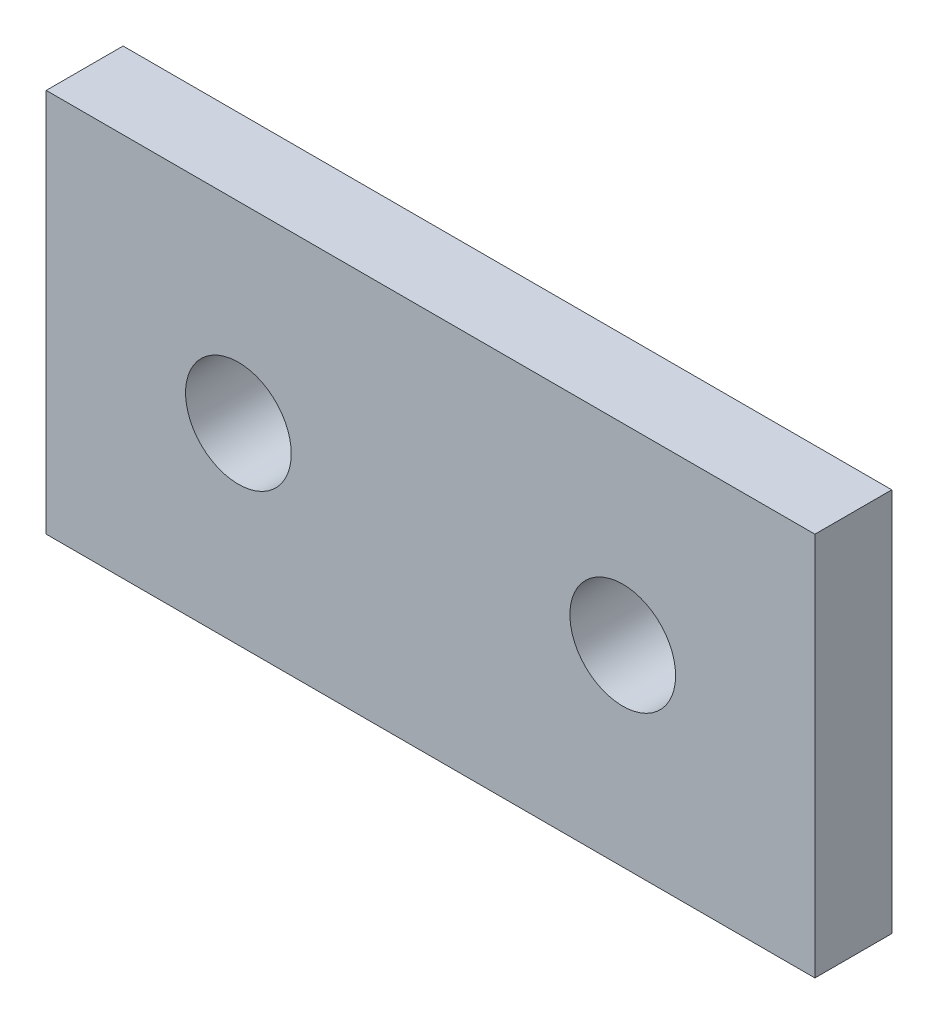
ISO-10303-21;
HEADER;
FILE_DESCRIPTION(('STEP AP214'),'2;1');
FILE_NAME('part.step','',(''),(''),'','','');
FILE_SCHEMA(('AUTOMOTIVE_DESIGN { 1 0 10303 214 1 1 1 1 }'));
ENDSEC;
DATA;
#1=APPLICATION_CONTEXT('core data for automotive mechanical design processes');
#2=APPLICATION_PROTOCOL_DEFINITION('international standard','automotive_design',2000,#1);
#3=PRODUCT_CONTEXT('',#1,'mechanical');
#4=PRODUCT('Part','Part','',(#3));
#5=PRODUCT_RELATED_PRODUCT_CATEGORY('part','',(#4));
#6=PRODUCT_DEFINITION_FORMATION('','',#4);
#7=PRODUCT_DEFINITION_CONTEXT('part definition',#1,'design');
#8=PRODUCT_DEFINITION('design','',#6,#7);
#9=PRODUCT_DEFINITION_SHAPE('','',#8);
#10=(LENGTH_UNIT() NAMED_UNIT(*) SI_UNIT(.MILLI.,.METRE.));
#11=(NAMED_UNIT(*) PLANE_ANGLE_UNIT() SI_UNIT($,.RADIAN.));
#12=(NAMED_UNIT(*) SI_UNIT($,.STERADIAN.) SOLID_ANGLE_UNIT());
#13=UNCERTAINTY_MEASURE_WITH_UNIT(LENGTH_MEASURE(1.E-05),#10,'distance_accuracy_value','');
#14=(GEOMETRIC_REPRESENTATION_CONTEXT(3) GLOBAL_UNCERTAINTY_ASSIGNED_CONTEXT((#13)) GLOBAL_UNIT_ASSIGNED_CONTEXT((#10,
#11,#12)) REPRESENTATION_CONTEXT('',''));
#15=CARTESIAN_POINT('',(0.,0.,0.));
#16=DIRECTION('',(0.,0.,1.));
#17=DIRECTION('',(1.,0.,0.));
#18=AXIS2_PLACEMENT_3D('',#15,#16,#17);
#19=CARTESIAN_POINT('',(0.,0.,2.));
#20=DIRECTION('',(0.,0.,-1.));
#21=DIRECTION('',(-1.,0.,0.));
#22=AXIS2_PLACEMENT_3D('',#19,#20,#21);
#23=PLANE('',#22);
#24=CARTESIAN_POINT('',(-10.,0.,2.));
#25=DIRECTION('',(0.,0.,1.));
#26=DIRECTION('',(1.,0.,0.));
#27=AXIS2_PLACEMENT_3D('',#24,#25,#26);
#28=CIRCLE('',#27,2.75);
#29=CARTESIAN_POINT('',(-7.25,0.,2.));
#30=VERTEX_POINT('',#29);
#31=EDGE_CURVE('E99',#30,#30,#28,.T.);
#32=ORIENTED_EDGE('',*,*,#31,.F.);
#33=EDGE_LOOP('',(#32));
#34=FACE_BOUND('',#33,.T.);
#35=DIRECTION('',(0.,1.,0.));
#36=VECTOR('',#35,1.);
#37=CARTESIAN_POINT('',(20.,-10.,2.));
#38=LINE('',#37,#36);
#39=CARTESIAN_POINT('',(20.,-10.,2.));
#40=VERTEX_POINT('',#39);
#41=CARTESIAN_POINT('',(20.,10.,2.));
#42=VERTEX_POINT('',#41);
#43=EDGE_CURVE('E84',#40,#42,#38,.T.);
#44=ORIENTED_EDGE('',*,*,#43,.T.);
#45=DIRECTION('',(-1.,0.,0.));
#46=VECTOR('',#45,1.);
#47=CARTESIAN_POINT('',(-20.,10.,2.));
#48=LINE('',#47,#46);
#49=CARTESIAN_POINT('',(-20.,10.,2.));
#50=VERTEX_POINT('',#49);
#51=EDGE_CURVE('E79',#42,#50,#48,.T.);
#52=ORIENTED_EDGE('',*,*,#51,.T.);
#53=DIRECTION('',(0.,-1.,0.));
#54=VECTOR('',#53,1.);
#55=CARTESIAN_POINT('',(-20.,-10.,2.));
#56=LINE('',#55,#54);
#57=CARTESIAN_POINT('',(-20.,-10.,2.));
#58=VERTEX_POINT('',#57);
#59=EDGE_CURVE('E82',#50,#58,#56,.T.);
#60=ORIENTED_EDGE('',*,*,#59,.T.);
#61=DIRECTION('',(1.,0.,0.));
#62=VECTOR('',#61,1.);
#63=CARTESIAN_POINT('',(-20.,-10.,2.));
#64=LINE('',#63,#62);
#65=EDGE_CURVE('E49',#58,#40,#64,.T.);
#66=ORIENTED_EDGE('',*,*,#65,.T.);
#67=EDGE_LOOP('',(#44,#52,#60,#66));
#68=FACE_BOUND('',#67,.T.);
#69=CARTESIAN_POINT('',(10.,0.,2.));
#70=DIRECTION('',(0.,0.,1.));
#71=DIRECTION('',(1.,0.,0.));
#72=AXIS2_PLACEMENT_3D('',#69,#70,#71);
#73=CIRCLE('',#72,2.75);
#74=CARTESIAN_POINT('',(12.75,0.,2.));
#75=VERTEX_POINT('',#74);
#76=EDGE_CURVE('E114',#75,#75,#73,.T.);
#77=ORIENTED_EDGE('',*,*,#76,.F.);
#78=EDGE_LOOP('',(#77));
#79=FACE_BOUND('',#78,.T.);
#80=ADVANCED_FACE('F32',(#34,#68,#79),#23,.F.);
#81=CARTESIAN_POINT('',(0.,0.,-2.));
#82=DIRECTION('',(0.,0.,-1.));
#83=DIRECTION('',(-1.,0.,0.));
#84=AXIS2_PLACEMENT_3D('',#81,#82,#83);
#85=PLANE('',#84);
#86=CARTESIAN_POINT('',(-10.,0.,-2.));
#87=DIRECTION('',(0.,0.,1.));
#88=DIRECTION('',(1.,0.,0.));
#89=AXIS2_PLACEMENT_3D('',#86,#87,#88);
#90=CIRCLE('',#89,2.75);
#91=CARTESIAN_POINT('',(-7.25,0.,-2.));
#92=VERTEX_POINT('',#91);
#93=EDGE_CURVE('E111',#92,#92,#90,.T.);
#94=ORIENTED_EDGE('',*,*,#93,.T.);
#95=EDGE_LOOP('',(#94));
#96=FACE_BOUND('',#95,.T.);
#97=DIRECTION('',(0.,1.,0.));
#98=VECTOR('',#97,1.);
#99=CARTESIAN_POINT('',(20.,-10.,-2.));
#100=LINE('',#99,#98);
#101=CARTESIAN_POINT('',(20.,-10.,-2.));
#102=VERTEX_POINT('',#101);
#103=CARTESIAN_POINT('',(20.,10.,-2.));
#104=VERTEX_POINT('',#103);
#105=EDGE_CURVE('E96',#102,#104,#100,.T.);
#106=ORIENTED_EDGE('',*,*,#105,.F.);
#107=DIRECTION('',(1.,0.,0.));
#108=VECTOR('',#107,1.);
#109=CARTESIAN_POINT('',(-20.,-10.,-2.));
#110=LINE('',#109,#108);
#111=CARTESIAN_POINT('',(-20.,-10.,-2.));
#112=VERTEX_POINT('',#111);
#113=EDGE_CURVE('E72',#112,#102,#110,.T.);
#114=ORIENTED_EDGE('',*,*,#113,.F.);
#115=DIRECTION('',(0.,-1.,0.));
#116=VECTOR('',#115,1.);
#117=CARTESIAN_POINT('',(-20.,-10.,-2.));
#118=LINE('',#117,#116);
#119=CARTESIAN_POINT('',(-20.,10.,-2.));
#120=VERTEX_POINT('',#119);
#121=EDGE_CURVE('E66',#120,#112,#118,.T.);
#122=ORIENTED_EDGE('',*,*,#121,.F.);
#123=DIRECTION('',(-1.,0.,0.));
#124=VECTOR('',#123,1.);
#125=CARTESIAN_POINT('',(-20.,10.,-2.));
#126=LINE('',#125,#124);
#127=EDGE_CURVE('E88',#104,#120,#126,.T.);
#128=ORIENTED_EDGE('',*,*,#127,.F.);
#129=EDGE_LOOP('',(#106,#114,#122,#128));
#130=FACE_BOUND('',#129,.T.);
#131=CARTESIAN_POINT('',(10.,0.,-2.));
#132=DIRECTION('',(0.,0.,1.));
#133=DIRECTION('',(1.,0.,0.));
#134=AXIS2_PLACEMENT_3D('',#131,#132,#133);
#135=CIRCLE('',#134,2.75);
#136=CARTESIAN_POINT('',(12.75,0.,-2.));
#137=VERTEX_POINT('',#136);
#138=EDGE_CURVE('E117',#137,#137,#135,.T.);
#139=ORIENTED_EDGE('',*,*,#138,.T.);
#140=EDGE_LOOP('',(#139));
#141=FACE_BOUND('',#140,.T.);
#142=ADVANCED_FACE('F107',(#96,#130,#141),#85,.T.);
#143=CARTESIAN_POINT('',(20.,-10.,2.));
#144=DIRECTION('',(-1.,0.,0.));
#145=DIRECTION('',(0.,0.,1.));
#146=AXIS2_PLACEMENT_3D('',#143,#144,#145);
#147=PLANE('',#146);
#148=ORIENTED_EDGE('',*,*,#105,.T.);
#149=DIRECTION('',(0.,0.,-1.));
#150=VECTOR('',#149,1.);
#151=CARTESIAN_POINT('',(20.,10.,2.));
#152=LINE('',#151,#150);
#153=EDGE_CURVE('E11',#42,#104,#152,.T.);
#154=ORIENTED_EDGE('',*,*,#153,.F.);
#155=ORIENTED_EDGE('',*,*,#43,.F.);
#156=DIRECTION('',(0.,0.,-1.));
#157=VECTOR('',#156,1.);
#158=CARTESIAN_POINT('',(20.,-10.,2.));
#159=LINE('',#158,#157);
#160=EDGE_CURVE('E92',#40,#102,#159,.T.);
#161=ORIENTED_EDGE('',*,*,#160,.T.);
#162=EDGE_LOOP('',(#148,#154,#155,#161));
#163=FACE_BOUND('',#162,.T.);
#164=ADVANCED_FACE('F34',(#163),#147,.F.);
#165=CARTESIAN_POINT('',(-20.,10.,2.));
#166=DIRECTION('',(0.,-1.,0.));
#167=DIRECTION('',(0.,0.,-1.));
#168=AXIS2_PLACEMENT_3D('',#165,#166,#167);
#169=PLANE('',#168);
#170=ORIENTED_EDGE('',*,*,#127,.T.);
#171=DIRECTION('',(0.,0.,-1.));
#172=VECTOR('',#171,1.);
#173=CARTESIAN_POINT('',(-20.,10.,2.));
#174=LINE('',#173,#172);
#175=EDGE_CURVE('E41',#50,#120,#174,.T.);
#176=ORIENTED_EDGE('',*,*,#175,.F.);
#177=ORIENTED_EDGE('',*,*,#51,.F.);
#178=ORIENTED_EDGE('',*,*,#153,.T.);
#179=EDGE_LOOP('',(#170,#176,#177,#178));
#180=FACE_BOUND('',#179,.T.);
#181=ADVANCED_FACE('F87',(#180),#169,.F.);
#182=CARTESIAN_POINT('',(-20.,-10.,2.));
#183=DIRECTION('',(1.,0.,0.));
#184=DIRECTION('',(0.,0.,-1.));
#185=AXIS2_PLACEMENT_3D('',#182,#183,#184);
#186=PLANE('',#185);
#187=ORIENTED_EDGE('',*,*,#121,.T.);
#188=DIRECTION('',(0.,0.,-1.));
#189=VECTOR('',#188,1.);
#190=CARTESIAN_POINT('',(-20.,-10.,2.));
#191=LINE('',#190,#189);
#192=EDGE_CURVE('E89',#58,#112,#191,.T.);
#193=ORIENTED_EDGE('',*,*,#192,.F.);
#194=ORIENTED_EDGE('',*,*,#59,.F.);
#195=ORIENTED_EDGE('',*,*,#175,.T.);
#196=EDGE_LOOP('',(#187,#193,#194,#195));
#197=FACE_BOUND('',#196,.T.);
#198=ADVANCED_FACE('F90',(#197),#186,.F.);
#199=CARTESIAN_POINT('',(-20.,-10.,2.));
#200=DIRECTION('',(0.,1.,0.));
#201=DIRECTION('',(0.,0.,1.));
#202=AXIS2_PLACEMENT_3D('',#199,#200,#201);
#203=PLANE('',#202);
#204=ORIENTED_EDGE('',*,*,#113,.T.);
#205=ORIENTED_EDGE('',*,*,#160,.F.);
#206=ORIENTED_EDGE('',*,*,#65,.F.);
#207=ORIENTED_EDGE('',*,*,#192,.T.);
#208=EDGE_LOOP('',(#204,#205,#206,#207));
#209=FACE_BOUND('',#208,.T.);
#210=ADVANCED_FACE('F104',(#209),#203,.F.);
#211=CARTESIAN_POINT('',(-10.,0.,2.));
#212=DIRECTION('',(0.,0.,-1.));
#213=DIRECTION('',(-1.,0.,0.));
#214=AXIS2_PLACEMENT_3D('',#211,#212,#213);
#215=CYLINDRICAL_SURFACE('',#214,2.75);
#216=ORIENTED_EDGE('',*,*,#31,.T.);
#217=EDGE_LOOP('',(#216));
#218=FACE_BOUND('',#217,.T.);
#219=ORIENTED_EDGE('',*,*,#93,.F.);
#220=EDGE_LOOP('',(#219));
#221=FACE_BOUND('',#220,.T.);
#222=ADVANCED_FACE('F135',(#218,#221),#215,.F.);
#223=CARTESIAN_POINT('',(10.,0.,2.));
#224=DIRECTION('',(0.,0.,-1.));
#225=DIRECTION('',(-1.,0.,0.));
#226=AXIS2_PLACEMENT_3D('',#223,#224,#225);
#227=CYLINDRICAL_SURFACE('',#226,2.75);
#228=ORIENTED_EDGE('',*,*,#76,.T.);
#229=EDGE_LOOP('',(#228));
#230=FACE_BOUND('',#229,.T.);
#231=ORIENTED_EDGE('',*,*,#138,.F.);
#232=EDGE_LOOP('',(#231));
#233=FACE_BOUND('',#232,.T.);
#234=ADVANCED_FACE('F123',(#230,#233),#227,.F.);
#235=CLOSED_SHELL('',(#80,#142,#164,#181,#198,#210,#222,#234));
#236=MANIFOLD_SOLID_BREP('B2',#235);
#237=ADVANCED_BREP_SHAPE_REPRESENTATION('',(#18,#236),#14);
#238=SHAPE_DEFINITION_REPRESENTATION(#9,#237);
ENDSEC;
END-ISO-10303-21;
